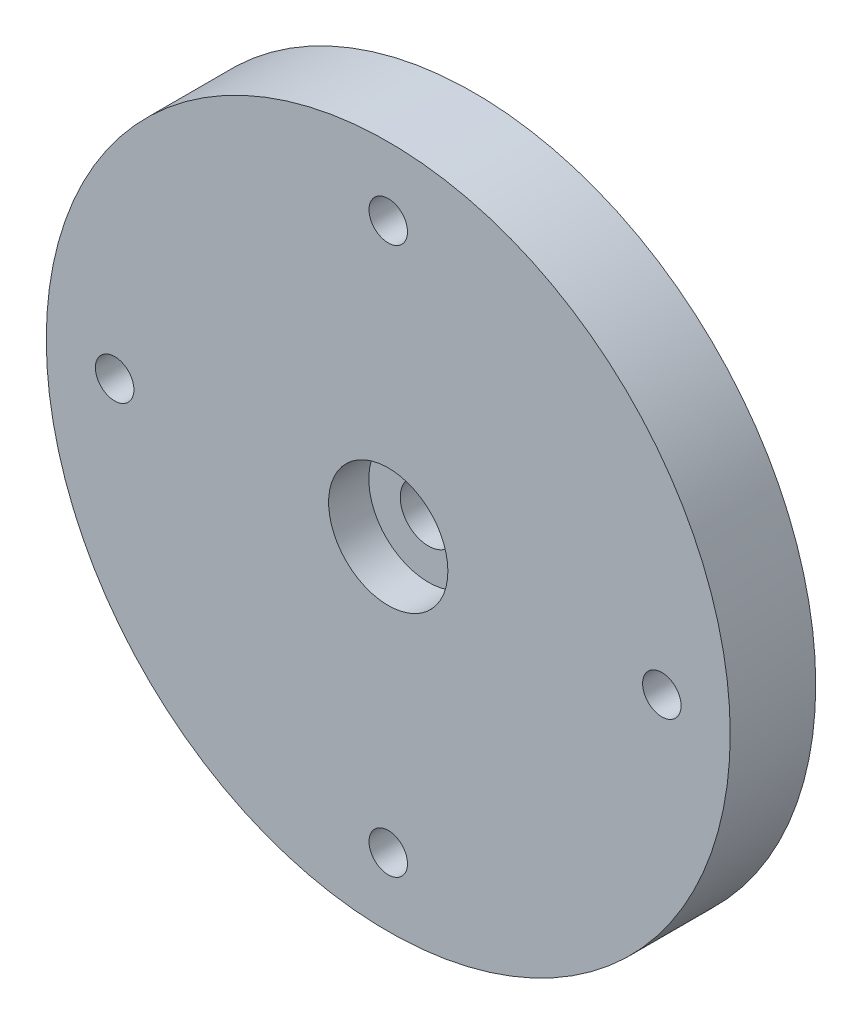
ISO-10303-21;
HEADER;
FILE_DESCRIPTION(('STEP AP214'),'2;1');
FILE_NAME('part.step','',(''),(''),'','','');
FILE_SCHEMA(('AUTOMOTIVE_DESIGN { 1 0 10303 214 1 1 1 1 }'));
ENDSEC;
DATA;
#1=APPLICATION_CONTEXT('core data for automotive mechanical design processes');
#2=APPLICATION_PROTOCOL_DEFINITION('international standard','automotive_design',2000,#1);
#3=PRODUCT_CONTEXT('',#1,'mechanical');
#4=PRODUCT('Part','Part','',(#3));
#5=PRODUCT_RELATED_PRODUCT_CATEGORY('part','',(#4));
#6=PRODUCT_DEFINITION_FORMATION('','',#4);
#7=PRODUCT_DEFINITION_CONTEXT('part definition',#1,'design');
#8=PRODUCT_DEFINITION('design','',#6,#7);
#9=PRODUCT_DEFINITION_SHAPE('','',#8);
#10=(LENGTH_UNIT() NAMED_UNIT(*) SI_UNIT(.MILLI.,.METRE.));
#11=(NAMED_UNIT(*) PLANE_ANGLE_UNIT() SI_UNIT($,.RADIAN.));
#12=(NAMED_UNIT(*) SI_UNIT($,.STERADIAN.) SOLID_ANGLE_UNIT());
#13=UNCERTAINTY_MEASURE_WITH_UNIT(LENGTH_MEASURE(1.E-05),#10,'distance_accuracy_value','');
#14=(GEOMETRIC_REPRESENTATION_CONTEXT(3) GLOBAL_UNCERTAINTY_ASSIGNED_CONTEXT((#13)) GLOBAL_UNIT_ASSIGNED_CONTEXT((#10,
#11,#12)) REPRESENTATION_CONTEXT('',''));
#15=CARTESIAN_POINT('',(0.,0.,0.));
#16=DIRECTION('',(0.,0.,1.));
#17=DIRECTION('',(1.,0.,0.));
#18=AXIS2_PLACEMENT_3D('',#15,#16,#17);
#19=CARTESIAN_POINT('',(0.,0.,10.));
#20=DIRECTION('',(0.,0.,1.));
#21=DIRECTION('',(1.,0.,0.));
#22=AXIS2_PLACEMENT_3D('',#19,#20,#21);
#23=CYLINDRICAL_SURFACE('',#22,3.3);
#24=CARTESIAN_POINT('',(0.,0.,5.3));
#25=DIRECTION('',(0.,0.,1.));
#26=DIRECTION('',(1.,0.,0.));
#27=AXIS2_PLACEMENT_3D('',#24,#25,#26);
#28=CIRCLE('',#27,3.3);
#29=CARTESIAN_POINT('',(3.3,0.,5.3));
#30=VERTEX_POINT('',#29);
#31=EDGE_CURVE('E47',#30,#30,#28,.T.);
#32=ORIENTED_EDGE('',*,*,#31,.T.);
#33=EDGE_LOOP('',(#32));
#34=FACE_BOUND('',#33,.T.);
#35=CARTESIAN_POINT('',(0.,0.,2.));
#36=DIRECTION('',(0.,0.,-1.));
#37=DIRECTION('',(-1.,0.,0.));
#38=AXIS2_PLACEMENT_3D('',#35,#36,#37);
#39=CIRCLE('',#38,3.3);
#40=CARTESIAN_POINT('',(-3.3,0.,2.));
#41=VERTEX_POINT('',#40);
#42=EDGE_CURVE('E38',#41,#41,#39,.F.);
#43=ORIENTED_EDGE('',*,*,#42,.F.);
#44=EDGE_LOOP('',(#43));
#45=FACE_BOUND('',#44,.T.);
#46=ADVANCED_FACE('F34',(#34,#45),#23,.F.);
#47=CARTESIAN_POINT('',(0.,0.,10.));
#48=DIRECTION('',(0.,0.,-1.));
#49=DIRECTION('',(-1.,0.,0.));
#50=AXIS2_PLACEMENT_3D('',#47,#48,#49);
#51=CYLINDRICAL_SURFACE('',#50,40.);
#52=CARTESIAN_POINT('',(0.,0.,10.));
#53=DIRECTION('',(0.,0.,1.));
#54=DIRECTION('',(1.,0.,0.));
#55=AXIS2_PLACEMENT_3D('',#52,#53,#54);
#56=CIRCLE('',#55,40.);
#57=CARTESIAN_POINT('',(40.,0.,10.));
#58=VERTEX_POINT('',#57);
#59=EDGE_CURVE('E10',#58,#58,#56,.T.);
#60=ORIENTED_EDGE('',*,*,#59,.F.);
#61=EDGE_LOOP('',(#60));
#62=FACE_BOUND('',#61,.T.);
#63=CARTESIAN_POINT('',(0.,0.,0.));
#64=DIRECTION('',(0.,0.,1.));
#65=DIRECTION('',(1.,0.,0.));
#66=AXIS2_PLACEMENT_3D('',#63,#64,#65);
#67=CIRCLE('',#66,40.);
#68=CARTESIAN_POINT('',(40.,0.,0.));
#69=VERTEX_POINT('',#68);
#70=EDGE_CURVE('E42',#69,#69,#67,.T.);
#71=ORIENTED_EDGE('',*,*,#70,.T.);
#72=EDGE_LOOP('',(#71));
#73=FACE_BOUND('',#72,.T.);
#74=ADVANCED_FACE('F36',(#62,#73),#51,.T.);
#75=CARTESIAN_POINT('',(0.,0.,10.));
#76=DIRECTION('',(0.,0.,1.));
#77=DIRECTION('',(1.,0.,0.));
#78=AXIS2_PLACEMENT_3D('',#75,#76,#77);
#79=PLANE('',#78);
#80=CARTESIAN_POINT('',(0.,32.,10.));
#81=DIRECTION('',(0.,0.,1.));
#82=DIRECTION('',(1.,0.,0.));
#83=AXIS2_PLACEMENT_3D('',#80,#81,#82);
#84=CIRCLE('',#83,2.25);
#85=CARTESIAN_POINT('',(2.25,32.,10.));
#86=VERTEX_POINT('',#85);
#87=EDGE_CURVE('E78',#86,#86,#84,.T.);
#88=ORIENTED_EDGE('',*,*,#87,.F.);
#89=EDGE_LOOP('',(#88));
#90=FACE_BOUND('',#89,.T.);
#91=CARTESIAN_POINT('',(32.,0.,10.));
#92=DIRECTION('',(0.,0.,1.));
#93=DIRECTION('',(1.,0.,0.));
#94=AXIS2_PLACEMENT_3D('',#91,#92,#93);
#95=CIRCLE('',#94,2.25);
#96=CARTESIAN_POINT('',(34.25,0.,10.));
#97=VERTEX_POINT('',#96);
#98=EDGE_CURVE('E72',#97,#97,#95,.T.);
#99=ORIENTED_EDGE('',*,*,#98,.F.);
#100=EDGE_LOOP('',(#99));
#101=FACE_BOUND('',#100,.T.);
#102=CARTESIAN_POINT('',(0.,-32.,10.));
#103=DIRECTION('',(0.,0.,1.));
#104=DIRECTION('',(1.,0.,0.));
#105=AXIS2_PLACEMENT_3D('',#102,#103,#104);
#106=CIRCLE('',#105,2.25);
#107=CARTESIAN_POINT('',(2.25,-32.,10.));
#108=VERTEX_POINT('',#107);
#109=EDGE_CURVE('E66',#108,#108,#106,.T.);
#110=ORIENTED_EDGE('',*,*,#109,.F.);
#111=EDGE_LOOP('',(#110));
#112=FACE_BOUND('',#111,.T.);
#113=CARTESIAN_POINT('',(-32.,0.,10.));
#114=DIRECTION('',(0.,0.,1.));
#115=DIRECTION('',(1.,0.,0.));
#116=AXIS2_PLACEMENT_3D('',#113,#114,#115);
#117=CIRCLE('',#116,2.25);
#118=CARTESIAN_POINT('',(-29.75,0.,10.));
#119=VERTEX_POINT('',#118);
#120=EDGE_CURVE('E60',#119,#119,#117,.T.);
#121=ORIENTED_EDGE('',*,*,#120,.F.);
#122=EDGE_LOOP('',(#121));
#123=FACE_BOUND('',#122,.T.);
#124=CARTESIAN_POINT('',(0.,0.,10.));
#125=DIRECTION('',(0.,0.,1.));
#126=DIRECTION('',(1.,0.,0.));
#127=AXIS2_PLACEMENT_3D('',#124,#125,#126);
#128=CIRCLE('',#127,6.975);
#129=CARTESIAN_POINT('',(6.975,0.,10.));
#130=VERTEX_POINT('',#129);
#131=EDGE_CURVE('E54',#130,#130,#128,.T.);
#132=ORIENTED_EDGE('',*,*,#131,.F.);
#133=EDGE_LOOP('',(#132));
#134=FACE_BOUND('',#133,.T.);
#135=ORIENTED_EDGE('',*,*,#59,.T.);
#136=EDGE_LOOP('',(#135));
#137=FACE_BOUND('',#136,.T.);
#138=ADVANCED_FACE('F99',(#90,#101,#112,#123,#134,#137),#79,.T.);
#139=CARTESIAN_POINT('',(0.,0.,0.));
#140=DIRECTION('',(0.,0.,1.));
#141=DIRECTION('',(1.,0.,0.));
#142=AXIS2_PLACEMENT_3D('',#139,#140,#141);
#143=PLANE('',#142);
#144=CARTESIAN_POINT('',(0.,0.,0.));
#145=DIRECTION('',(0.,0.,-1.));
#146=DIRECTION('',(-1.,0.,0.));
#147=AXIS2_PLACEMENT_3D('',#144,#145,#146);
#148=CIRCLE('',#147,8.5);
#149=CARTESIAN_POINT('',(-8.5,0.,0.));
#150=VERTEX_POINT('',#149);
#151=EDGE_CURVE('E81',#150,#150,#148,.T.);
#152=ORIENTED_EDGE('',*,*,#151,.F.);
#153=EDGE_LOOP('',(#152));
#154=FACE_BOUND('',#153,.T.);
#155=CARTESIAN_POINT('',(0.,32.,0.));
#156=DIRECTION('',(0.,0.,1.));
#157=DIRECTION('',(1.,0.,0.));
#158=AXIS2_PLACEMENT_3D('',#155,#156,#157);
#159=CIRCLE('',#158,2.25);
#160=CARTESIAN_POINT('',(2.25,32.,0.));
#161=VERTEX_POINT('',#160);
#162=EDGE_CURVE('E75',#161,#161,#159,.T.);
#163=ORIENTED_EDGE('',*,*,#162,.T.);
#164=EDGE_LOOP('',(#163));
#165=FACE_BOUND('',#164,.T.);
#166=CARTESIAN_POINT('',(32.,0.,0.));
#167=DIRECTION('',(0.,0.,1.));
#168=DIRECTION('',(1.,0.,0.));
#169=AXIS2_PLACEMENT_3D('',#166,#167,#168);
#170=CIRCLE('',#169,2.25);
#171=CARTESIAN_POINT('',(34.25,0.,0.));
#172=VERTEX_POINT('',#171);
#173=EDGE_CURVE('E69',#172,#172,#170,.T.);
#174=ORIENTED_EDGE('',*,*,#173,.T.);
#175=EDGE_LOOP('',(#174));
#176=FACE_BOUND('',#175,.T.);
#177=CARTESIAN_POINT('',(0.,-32.,0.));
#178=DIRECTION('',(0.,0.,1.));
#179=DIRECTION('',(1.,0.,0.));
#180=AXIS2_PLACEMENT_3D('',#177,#178,#179);
#181=CIRCLE('',#180,2.25);
#182=CARTESIAN_POINT('',(2.25,-32.,0.));
#183=VERTEX_POINT('',#182);
#184=EDGE_CURVE('E63',#183,#183,#181,.T.);
#185=ORIENTED_EDGE('',*,*,#184,.T.);
#186=EDGE_LOOP('',(#185));
#187=FACE_BOUND('',#186,.T.);
#188=CARTESIAN_POINT('',(-32.,0.,0.));
#189=DIRECTION('',(0.,0.,1.));
#190=DIRECTION('',(1.,0.,0.));
#191=AXIS2_PLACEMENT_3D('',#188,#189,#190);
#192=CIRCLE('',#191,2.25);
#193=CARTESIAN_POINT('',(-29.75,0.,0.));
#194=VERTEX_POINT('',#193);
#195=EDGE_CURVE('E57',#194,#194,#192,.T.);
#196=ORIENTED_EDGE('',*,*,#195,.T.);
#197=EDGE_LOOP('',(#196));
#198=FACE_BOUND('',#197,.T.);
#199=ORIENTED_EDGE('',*,*,#70,.F.);
#200=EDGE_LOOP('',(#199));
#201=FACE_BOUND('',#200,.T.);
#202=ADVANCED_FACE('F106',(#154,#165,#176,#187,#198,#201),#143,.F.);
#203=CARTESIAN_POINT('',(3.3,0.,5.3));
#204=DIRECTION('',(0.,0.,-1.));
#205=DIRECTION('',(-1.,0.,0.));
#206=AXIS2_PLACEMENT_3D('',#203,#204,#205);
#207=PLANE('',#206);
#208=ORIENTED_EDGE('',*,*,#31,.F.);
#209=EDGE_LOOP('',(#208));
#210=FACE_BOUND('',#209,.T.);
#211=CARTESIAN_POINT('',(0.,0.,5.3));
#212=DIRECTION('',(0.,0.,1.));
#213=DIRECTION('',(1.,0.,0.));
#214=AXIS2_PLACEMENT_3D('',#211,#212,#213);
#215=CIRCLE('',#214,6.975);
#216=CARTESIAN_POINT('',(6.975,0.,5.3));
#217=VERTEX_POINT('',#216);
#218=EDGE_CURVE('E51',#217,#217,#215,.T.);
#219=ORIENTED_EDGE('',*,*,#218,.T.);
#220=EDGE_LOOP('',(#219));
#221=FACE_BOUND('',#220,.T.);
#222=ADVANCED_FACE('F103',(#210,#221),#207,.F.);
#223=CARTESIAN_POINT('',(0.,0.,10.));
#224=DIRECTION('',(0.,0.,1.));
#225=DIRECTION('',(1.,0.,0.));
#226=AXIS2_PLACEMENT_3D('',#223,#224,#225);
#227=CYLINDRICAL_SURFACE('',#226,6.975);
#228=ORIENTED_EDGE('',*,*,#218,.F.);
#229=EDGE_LOOP('',(#228));
#230=FACE_BOUND('',#229,.T.);
#231=ORIENTED_EDGE('',*,*,#131,.T.);
#232=EDGE_LOOP('',(#231));
#233=FACE_BOUND('',#232,.T.);
#234=ADVANCED_FACE('F113',(#230,#233),#227,.F.);
#235=CARTESIAN_POINT('',(-32.,0.,10.));
#236=DIRECTION('',(0.,0.,1.));
#237=DIRECTION('',(1.,0.,0.));
#238=AXIS2_PLACEMENT_3D('',#235,#236,#237);
#239=CYLINDRICAL_SURFACE('',#238,2.25);
#240=ORIENTED_EDGE('',*,*,#195,.F.);
#241=EDGE_LOOP('',(#240));
#242=FACE_BOUND('',#241,.T.);
#243=ORIENTED_EDGE('',*,*,#120,.T.);
#244=EDGE_LOOP('',(#243));
#245=FACE_BOUND('',#244,.T.);
#246=ADVANCED_FACE('F128',(#242,#245),#239,.F.);
#247=CARTESIAN_POINT('',(0.,-32.,10.));
#248=DIRECTION('',(0.,0.,1.));
#249=DIRECTION('',(1.,0.,0.));
#250=AXIS2_PLACEMENT_3D('',#247,#248,#249);
#251=CYLINDRICAL_SURFACE('',#250,2.25);
#252=ORIENTED_EDGE('',*,*,#184,.F.);
#253=EDGE_LOOP('',(#252));
#254=FACE_BOUND('',#253,.T.);
#255=ORIENTED_EDGE('',*,*,#109,.T.);
#256=EDGE_LOOP('',(#255));
#257=FACE_BOUND('',#256,.T.);
#258=ADVANCED_FACE('F131',(#254,#257),#251,.F.);
#259=CARTESIAN_POINT('',(32.,0.,10.));
#260=DIRECTION('',(0.,0.,1.));
#261=DIRECTION('',(1.,0.,0.));
#262=AXIS2_PLACEMENT_3D('',#259,#260,#261);
#263=CYLINDRICAL_SURFACE('',#262,2.25);
#264=ORIENTED_EDGE('',*,*,#173,.F.);
#265=EDGE_LOOP('',(#264));
#266=FACE_BOUND('',#265,.T.);
#267=ORIENTED_EDGE('',*,*,#98,.T.);
#268=EDGE_LOOP('',(#267));
#269=FACE_BOUND('',#268,.T.);
#270=ADVANCED_FACE('F146',(#266,#269),#263,.F.);
#271=CARTESIAN_POINT('',(0.,32.,10.));
#272=DIRECTION('',(0.,0.,1.));
#273=DIRECTION('',(1.,0.,0.));
#274=AXIS2_PLACEMENT_3D('',#271,#272,#273);
#275=CYLINDRICAL_SURFACE('',#274,2.25);
#276=ORIENTED_EDGE('',*,*,#162,.F.);
#277=EDGE_LOOP('',(#276));
#278=FACE_BOUND('',#277,.T.);
#279=ORIENTED_EDGE('',*,*,#87,.T.);
#280=EDGE_LOOP('',(#279));
#281=FACE_BOUND('',#280,.T.);
#282=ADVANCED_FACE('F150',(#278,#281),#275,.F.);
#283=CARTESIAN_POINT('',(0.,0.,2.));
#284=DIRECTION('',(0.,0.,-1.));
#285=DIRECTION('',(-1.,0.,0.));
#286=AXIS2_PLACEMENT_3D('',#283,#284,#285);
#287=PLANE('',#286);
#288=CARTESIAN_POINT('',(0.,0.,2.));
#289=DIRECTION('',(0.,0.,-1.));
#290=DIRECTION('',(-1.,0.,0.));
#291=AXIS2_PLACEMENT_3D('',#288,#289,#290);
#292=CIRCLE('',#291,8.5);
#293=CARTESIAN_POINT('',(-8.5,0.,2.));
#294=VERTEX_POINT('',#293);
#295=EDGE_CURVE('E84',#294,#294,#292,.T.);
#296=ORIENTED_EDGE('',*,*,#295,.T.);
#297=EDGE_LOOP('',(#296));
#298=FACE_BOUND('',#297,.T.);
#299=ORIENTED_EDGE('',*,*,#42,.T.);
#300=EDGE_LOOP('',(#299));
#301=FACE_BOUND('',#300,.T.);
#302=ADVANCED_FACE('F91',(#298,#301),#287,.T.);
#303=CARTESIAN_POINT('',(0.,0.,2.));
#304=DIRECTION('',(0.,0.,-1.));
#305=DIRECTION('',(-1.,0.,0.));
#306=AXIS2_PLACEMENT_3D('',#303,#304,#305);
#307=CYLINDRICAL_SURFACE('',#306,8.5);
#308=ORIENTED_EDGE('',*,*,#295,.F.);
#309=EDGE_LOOP('',(#308));
#310=FACE_BOUND('',#309,.T.);
#311=ORIENTED_EDGE('',*,*,#151,.T.);
#312=EDGE_LOOP('',(#311));
#313=FACE_BOUND('',#312,.T.);
#314=ADVANCED_FACE('F155',(#310,#313),#307,.F.);
#315=CLOSED_SHELL('',(#46,#74,#138,#202,#222,#234,#246,#258,#270,#282,#302,#314));
#316=MANIFOLD_SOLID_BREP('B2',#315);
#317=ADVANCED_BREP_SHAPE_REPRESENTATION('',(#18,#316),#14);
#318=SHAPE_DEFINITION_REPRESENTATION(#9,#317);
ENDSEC;
END-ISO-10303-21;
